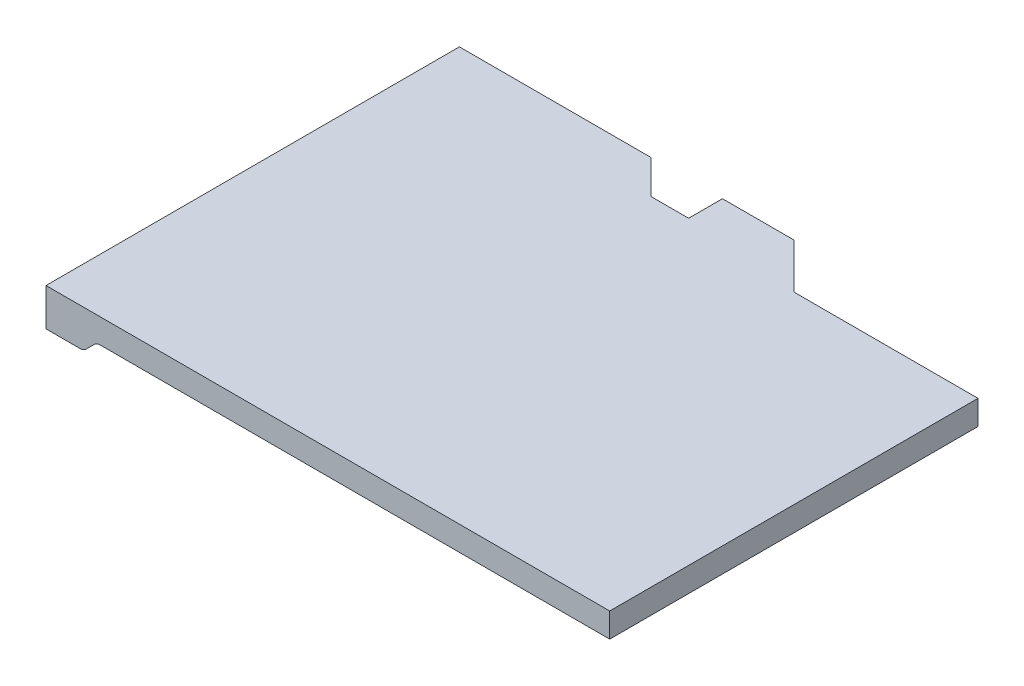
ISO-10303-21;
HEADER;
FILE_DESCRIPTION(('STEP AP214'),'2;1');
FILE_NAME('part.step','',(''),(''),'','','');
FILE_SCHEMA(('AUTOMOTIVE_DESIGN { 1 0 10303 214 1 1 1 1 }'));
ENDSEC;
DATA;
#1=APPLICATION_CONTEXT('core data for automotive mechanical design processes');
#2=APPLICATION_PROTOCOL_DEFINITION('international standard','automotive_design',2000,#1);
#3=PRODUCT_CONTEXT('',#1,'mechanical');
#4=PRODUCT('Part','Part','',(#3));
#5=PRODUCT_RELATED_PRODUCT_CATEGORY('part','',(#4));
#6=PRODUCT_DEFINITION_FORMATION('','',#4);
#7=PRODUCT_DEFINITION_CONTEXT('part definition',#1,'design');
#8=PRODUCT_DEFINITION('design','',#6,#7);
#9=PRODUCT_DEFINITION_SHAPE('','',#8);
#10=(LENGTH_UNIT() NAMED_UNIT(*) SI_UNIT(.MILLI.,.METRE.));
#11=(NAMED_UNIT(*) PLANE_ANGLE_UNIT() SI_UNIT($,.RADIAN.));
#12=(NAMED_UNIT(*) SI_UNIT($,.STERADIAN.) SOLID_ANGLE_UNIT());
#13=UNCERTAINTY_MEASURE_WITH_UNIT(LENGTH_MEASURE(1.E-05),#10,'distance_accuracy_value','');
#14=(GEOMETRIC_REPRESENTATION_CONTEXT(3) GLOBAL_UNCERTAINTY_ASSIGNED_CONTEXT((#13)) GLOBAL_UNIT_ASSIGNED_CONTEXT((#10,
#11,#12)) REPRESENTATION_CONTEXT('',''));
#15=CARTESIAN_POINT('',(0.,0.,0.));
#16=DIRECTION('',(0.,0.,1.));
#17=DIRECTION('',(1.,0.,0.));
#18=AXIS2_PLACEMENT_3D('',#15,#16,#17);
#19=CARTESIAN_POINT('',(-37.0000000000034,-9.09999999998325,12.5499999999617));
#20=DIRECTION('',(0.,0.,1.));
#21=DIRECTION('',(1.,0.,0.));
#22=AXIS2_PLACEMENT_3D('',#19,#20,#21);
#23=PLANE('',#22);
#24=DIRECTION('',(0.,-1.,0.));
#25=VECTOR('',#24,1.);
#26=CARTESIAN_POINT('',(-44.500000000006,-9.09999999998325,12.5499999999601));
#27=LINE('',#26,#25);
#28=CARTESIAN_POINT('',(-44.500000000006,-9.09999999998325,12.5499999999601));
#29=VERTEX_POINT('',#28);
#30=CARTESIAN_POINT('',(-44.500000000006,-10.0999999999833,12.5499999999601));
#31=VERTEX_POINT('',#30);
#32=EDGE_CURVE('E11',#29,#31,#27,.T.);
#33=ORIENTED_EDGE('',*,*,#32,.T.);
#34=DIRECTION('',(-1.,0.,-1.00316141586462E-12));
#35=VECTOR('',#34,1.);
#36=CARTESIAN_POINT('',(-43.6035533905924,-10.0999999999833,12.549999999961));
#37=LINE('',#36,#35);
#38=CARTESIAN_POINT('',(-43.6035533905924,-10.0999999999833,12.549999999961));
#39=VERTEX_POINT('',#38);
#40=EDGE_CURVE('E42',#39,#31,#37,.T.);
#41=ORIENTED_EDGE('',*,*,#40,.F.);
#42=CARTESIAN_POINT('',(-43.6035533905927,-9.84999999998285,12.5499999999617));
#43=DIRECTION('',(0.,0.,-1.));
#44=DIRECTION('',(1.06581410363822E-12,-1.,0.));
#45=AXIS2_PLACEMENT_3D('',#42,#43,#44);
#46=CIRCLE('',#45,0.250000000000452);
#47=CARTESIAN_POINT('',(-43.4267766952891,-10.0267766952746,12.5499999999614));
#48=VERTEX_POINT('',#47);
#49=EDGE_CURVE('E220',#48,#39,#46,.T.);
#50=ORIENTED_EDGE('',*,*,#49,.F.);
#51=DIRECTION('',(-0.707106781178456,-0.707106781194639,-6.9420765177515E-13));
#52=VECTOR('',#51,1.);
#53=CARTESIAN_POINT('',(-43.223223304717,-9.82322330469785,12.5499999999616));
#54=LINE('',#53,#52);
#55=CARTESIAN_POINT('',(-43.2232233047223,-9.8232233046926,12.5499999999617));
#56=VERTEX_POINT('',#55);
#57=EDGE_CURVE('E209',#56,#48,#54,.T.);
#58=ORIENTED_EDGE('',*,*,#57,.F.);
#59=CARTESIAN_POINT('',(-43.0464466094196,-9.9999999999834,12.5499999999617));
#60=DIRECTION('',(0.,1.06937989309214E-13,1.));
#61=DIRECTION('',(-0.707106781210313,0.707106781162782,-1.06581410363951E-13));
#62=AXIS2_PLACEMENT_3D('',#59,#60,#61);
#63=CIRCLE('',#62,0.250000000000151);
#64=CARTESIAN_POINT('',(-43.0464466094196,-9.74999999998325,12.5499999999617));
#65=VERTEX_POINT('',#64);
#66=EDGE_CURVE('E176',#65,#56,#63,.T.);
#67=ORIENTED_EDGE('',*,*,#66,.F.);
#68=DIRECTION('',(-1.,0.,-1.08527156353091E-12));
#69=VECTOR('',#68,1.);
#70=CARTESIAN_POINT('',(-29.500000000006,-9.74999999998325,12.5499999999763));
#71=LINE('',#70,#69);
#72=CARTESIAN_POINT('',(-29.500000000006,-9.74999999998325,12.5499999999763));
#73=VERTEX_POINT('',#72);
#74=EDGE_CURVE('E247',#73,#65,#71,.T.);
#75=ORIENTED_EDGE('',*,*,#74,.F.);
#76=DIRECTION('',(0.,-1.,0.));
#77=VECTOR('',#76,1.);
#78=CARTESIAN_POINT('',(-29.500000000006,-9.09999999998325,12.5499999999763));
#79=LINE('',#78,#77);
#80=CARTESIAN_POINT('',(-29.4999999999955,-9.09999999998325,12.5499999999763));
#81=VERTEX_POINT('',#80);
#82=EDGE_CURVE('E231',#81,#73,#79,.T.);
#83=ORIENTED_EDGE('',*,*,#82,.F.);
#84=DIRECTION('',(-1.,0.,-1.0800249583546E-12));
#85=VECTOR('',#84,1.);
#86=CARTESIAN_POINT('',(-29.4999999999955,-9.09999999998325,12.5499999999763));
#87=LINE('',#86,#85);
#88=EDGE_CURVE('E28',#81,#29,#87,.T.);
#89=ORIENTED_EDGE('',*,*,#88,.T.);
#90=EDGE_LOOP('',(#33,#41,#50,#58,#67,#75,#83,#89));
#91=FACE_BOUND('',#90,.T.);
#92=ADVANCED_FACE('F17',(#91),#23,.T.);
#93=CARTESIAN_POINT('',(-29.5000000000007,-9.09999999998325,7.64999999997628));
#94=DIRECTION('',(1.,0.,0.));
#95=DIRECTION('',(0.,-1.07170508295448E-12,1.));
#96=AXIS2_PLACEMENT_3D('',#93,#94,#95);
#97=PLANE('',#96);
#98=DIRECTION('',(-1.07170508295448E-12,0.,1.));
#99=VECTOR('',#98,1.);
#100=CARTESIAN_POINT('',(-29.4999999999955,-9.09999999998325,2.74999999997626));
#101=LINE('',#100,#99);
#102=CARTESIAN_POINT('',(-29.4999999999955,-9.09999999998325,2.74999999997626));
#103=VERTEX_POINT('',#102);
#104=EDGE_CURVE('E227',#103,#81,#101,.T.);
#105=ORIENTED_EDGE('',*,*,#104,.T.);
#106=ORIENTED_EDGE('',*,*,#82,.T.);
#107=DIRECTION('',(-1.07170508295448E-12,0.,1.));
#108=VECTOR('',#107,1.);
#109=CARTESIAN_POINT('',(-29.4999999999955,-9.74999999998325,2.74999999997626));
#110=LINE('',#109,#108);
#111=CARTESIAN_POINT('',(-29.4999999999955,-9.74999999998325,2.74999999997626));
#112=VERTEX_POINT('',#111);
#113=EDGE_CURVE('E160',#112,#73,#110,.T.);
#114=ORIENTED_EDGE('',*,*,#113,.F.);
#115=DIRECTION('',(0.,-1.,0.));
#116=VECTOR('',#115,1.);
#117=CARTESIAN_POINT('',(-29.4999999999955,-9.09999999998325,2.74999999997626));
#118=LINE('',#117,#116);
#119=EDGE_CURVE('E154',#103,#112,#118,.T.);
#120=ORIENTED_EDGE('',*,*,#119,.F.);
#121=EDGE_LOOP('',(#105,#106,#114,#120));
#122=FACE_BOUND('',#121,.T.);
#123=ADVANCED_FACE('F315',(#122),#97,.T.);
#124=CARTESIAN_POINT('',(-31.9499999999955,-9.09999999998325,2.74999999997362));
#125=DIRECTION('',(1.07952195935236E-12,0.,-1.));
#126=DIRECTION('',(0.,-1.,0.));
#127=AXIS2_PLACEMENT_3D('',#124,#125,#126);
#128=PLANE('',#127);
#129=DIRECTION('',(1.,0.,1.07952195935236E-12));
#130=VECTOR('',#129,1.);
#131=CARTESIAN_POINT('',(-34.3999999999955,-9.09999999998325,2.74999999997097));
#132=LINE('',#131,#130);
#133=CARTESIAN_POINT('',(-34.3999999999955,-9.09999999998325,2.74999999997097));
#134=VERTEX_POINT('',#133);
#135=EDGE_CURVE('E265',#134,#103,#132,.T.);
#136=ORIENTED_EDGE('',*,*,#135,.T.);
#137=ORIENTED_EDGE('',*,*,#119,.T.);
#138=DIRECTION('',(1.,0.,1.07952195935467E-12));
#139=VECTOR('',#138,1.);
#140=CARTESIAN_POINT('',(-34.3999999999955,-9.74999999998325,2.74999999997097));
#141=LINE('',#140,#139);
#142=CARTESIAN_POINT('',(-34.3999999999955,-9.74999999998325,2.74999999997096));
#143=VERTEX_POINT('',#142);
#144=EDGE_CURVE('E148',#143,#112,#141,.T.);
#145=ORIENTED_EDGE('',*,*,#144,.F.);
#146=DIRECTION('',(0.,-1.,0.));
#147=VECTOR('',#146,1.);
#148=CARTESIAN_POINT('',(-34.3999999999955,-9.09999999998325,2.74999999997096));
#149=LINE('',#148,#147);
#150=EDGE_CURVE('E152',#134,#143,#149,.T.);
#151=ORIENTED_EDGE('',*,*,#150,.F.);
#152=EDGE_LOOP('',(#136,#137,#145,#151));
#153=FACE_BOUND('',#152,.T.);
#154=ADVANCED_FACE('F151',(#153),#128,.T.);
#155=CARTESIAN_POINT('',(-34.9999999999948,-9.09999999998325,2.14999999997032));
#156=DIRECTION('',(0.707106781187338,0.,-0.707106781185757));
#157=DIRECTION('',(0.,-1.,0.));
#158=AXIS2_PLACEMENT_3D('',#155,#156,#157);
#159=PLANE('',#158);
#160=DIRECTION('',(0.707106781185754,0.,0.707106781187341));
#161=VECTOR('',#160,1.);
#162=CARTESIAN_POINT('',(-35.5999999999941,-9.09999999998325,1.54999999996968));
#163=LINE('',#162,#161);
#164=CARTESIAN_POINT('',(-35.5999999999941,-9.09999999998325,1.54999999996968));
#165=VERTEX_POINT('',#164);
#166=EDGE_CURVE('E168',#165,#134,#163,.T.);
#167=ORIENTED_EDGE('',*,*,#166,.T.);
#168=ORIENTED_EDGE('',*,*,#150,.T.);
#169=DIRECTION('',(0.707106781185786,0.,0.707106781187309));
#170=VECTOR('',#169,1.);
#171=CARTESIAN_POINT('',(-35.5999999999942,-9.74999999998325,1.54999999996968));
#172=LINE('',#171,#170);
#173=CARTESIAN_POINT('',(-35.5999999999941,-9.74999999998325,1.54999999996968));
#174=VERTEX_POINT('',#173);
#175=EDGE_CURVE('E165',#174,#143,#172,.T.);
#176=ORIENTED_EDGE('',*,*,#175,.F.);
#177=DIRECTION('',(0.,-1.,0.));
#178=VECTOR('',#177,1.);
#179=CARTESIAN_POINT('',(-35.5999999999941,-9.09999999998325,1.54999999996968));
#180=LINE('',#179,#178);
#181=EDGE_CURVE('E242',#165,#174,#180,.T.);
#182=ORIENTED_EDGE('',*,*,#181,.F.);
#183=EDGE_LOOP('',(#167,#168,#176,#182));
#184=FACE_BOUND('',#183,.T.);
#185=ADVANCED_FACE('F164',(#184),#159,.T.);
#186=CARTESIAN_POINT('',(-36.5499999999942,-9.09999999998325,1.54999999996866));
#187=DIRECTION('',(1.07896148156328E-12,0.,-1.));
#188=DIRECTION('',(0.,-1.,0.));
#189=AXIS2_PLACEMENT_3D('',#186,#187,#188);
#190=PLANE('',#189);
#191=DIRECTION('',(1.,0.,1.07896148156328E-12));
#192=VECTOR('',#191,1.);
#193=CARTESIAN_POINT('',(-37.4999999999942,-9.09999999998325,1.54999999996763));
#194=LINE('',#193,#192);
#195=CARTESIAN_POINT('',(-37.4999999999942,-9.09999999998325,1.54999999996763));
#196=VERTEX_POINT('',#195);
#197=EDGE_CURVE('E21',#196,#165,#194,.T.);
#198=ORIENTED_EDGE('',*,*,#197,.T.);
#199=ORIENTED_EDGE('',*,*,#181,.T.);
#200=DIRECTION('',(1.,0.,1.07896148156328E-12));
#201=VECTOR('',#200,1.);
#202=CARTESIAN_POINT('',(-37.4999999999942,-9.74999999998325,1.54999999996763));
#203=LINE('',#202,#201);
#204=CARTESIAN_POINT('',(-37.4999999999942,-9.74999999998325,1.54999999996763));
#205=VERTEX_POINT('',#204);
#206=EDGE_CURVE('E174',#205,#174,#203,.T.);
#207=ORIENTED_EDGE('',*,*,#206,.F.);
#208=DIRECTION('',(0.,-1.,0.));
#209=VECTOR('',#208,1.);
#210=CARTESIAN_POINT('',(-37.4999999999942,-9.09999999998325,1.54999999996763));
#211=LINE('',#210,#209);
#212=EDGE_CURVE('E196',#196,#205,#211,.T.);
#213=ORIENTED_EDGE('',*,*,#212,.F.);
#214=EDGE_LOOP('',(#198,#199,#207,#213));
#215=FACE_BOUND('',#214,.T.);
#216=ADVANCED_FACE('F349',(#215),#190,.T.);
#217=CARTESIAN_POINT('',(-37.4999999999947,-9.09999999998325,1.99999999996763));
#218=DIRECTION('',(-1.,0.,-9.91799235331806E-13));
#219=DIRECTION('',(-9.91799235331806E-13,0.,1.));
#220=AXIS2_PLACEMENT_3D('',#217,#218,#219);
#221=PLANE('',#220);
#222=DIRECTION('',(9.91799235331817E-13,0.,-1.));
#223=VECTOR('',#222,1.);
#224=CARTESIAN_POINT('',(-37.4999999999951,-9.09999999998325,2.44999999996762));
#225=LINE('',#224,#223);
#226=CARTESIAN_POINT('',(-37.4999999999951,-9.09999999998325,2.44999999996762));
#227=VERTEX_POINT('',#226);
#228=EDGE_CURVE('E201',#227,#196,#225,.T.);
#229=ORIENTED_EDGE('',*,*,#228,.T.);
#230=ORIENTED_EDGE('',*,*,#212,.T.);
#231=DIRECTION('',(9.91799235331817E-13,0.,-1.));
#232=VECTOR('',#231,1.);
#233=CARTESIAN_POINT('',(-37.4999999999951,-9.74999999998325,2.44999999996762));
#234=LINE('',#233,#232);
#235=CARTESIAN_POINT('',(-37.4999999999951,-9.74999999998325,2.44999999996762));
#236=VERTEX_POINT('',#235);
#237=EDGE_CURVE('E182',#236,#205,#234,.T.);
#238=ORIENTED_EDGE('',*,*,#237,.F.);
#239=DIRECTION('',(0.,-1.,0.));
#240=VECTOR('',#239,1.);
#241=CARTESIAN_POINT('',(-37.4999999999951,-9.09999999998325,2.44999999996762));
#242=LINE('',#241,#240);
#243=EDGE_CURVE('E197',#227,#236,#242,.T.);
#244=ORIENTED_EDGE('',*,*,#243,.F.);
#245=EDGE_LOOP('',(#229,#230,#238,#244));
#246=FACE_BOUND('',#245,.T.);
#247=ADVANCED_FACE('F346',(#246),#221,.T.);
#248=CARTESIAN_POINT('',(-37.9999999999951,-9.09999999998325,2.44999999996709));
#249=DIRECTION('',(1.06997743998249E-12,0.,-1.));
#250=DIRECTION('',(0.,-1.,0.));
#251=AXIS2_PLACEMENT_3D('',#248,#249,#250);
#252=PLANE('',#251);
#253=DIRECTION('',(1.,0.,1.06997743998249E-12));
#254=VECTOR('',#253,1.);
#255=CARTESIAN_POINT('',(-38.4999999999951,-9.09999999998325,2.44999999996655));
#256=LINE('',#255,#254);
#257=CARTESIAN_POINT('',(-38.4999999999951,-9.09999999998325,2.44999999996655));
#258=VERTEX_POINT('',#257);
#259=EDGE_CURVE('E192',#258,#227,#256,.T.);
#260=ORIENTED_EDGE('',*,*,#259,.T.);
#261=ORIENTED_EDGE('',*,*,#243,.T.);
#262=DIRECTION('',(1.,0.,1.06997743998249E-12));
#263=VECTOR('',#262,1.);
#264=CARTESIAN_POINT('',(-38.4999999999951,-9.74999999998325,2.44999999996655));
#265=LINE('',#264,#263);
#266=CARTESIAN_POINT('',(-38.4999999999951,-9.74999999998325,2.44999999996655));
#267=VERTEX_POINT('',#266);
#268=EDGE_CURVE('E202',#267,#236,#265,.T.);
#269=ORIENTED_EDGE('',*,*,#268,.F.);
#270=DIRECTION('',(0.,-1.,0.));
#271=VECTOR('',#270,1.);
#272=CARTESIAN_POINT('',(-38.4999999999951,-9.09999999998325,2.44999999996655));
#273=LINE('',#272,#271);
#274=EDGE_CURVE('E216',#258,#267,#273,.T.);
#275=ORIENTED_EDGE('',*,*,#274,.F.);
#276=EDGE_LOOP('',(#260,#261,#269,#275));
#277=FACE_BOUND('',#276,.T.);
#278=ADVANCED_FACE('F344',(#277),#252,.T.);
#279=CARTESIAN_POINT('',(-38.9499999999946,-9.09999999998325,1.99999999996606));
#280=DIRECTION('',(0.70710678118732,0.,-0.707106781185775));
#281=DIRECTION('',(0.,-1.,0.));
#282=AXIS2_PLACEMENT_3D('',#279,#280,#281);
#283=PLANE('',#282);
#284=DIRECTION('',(0.707106781185815,0.,0.70710678118728));
#285=VECTOR('',#284,1.);
#286=CARTESIAN_POINT('',(-39.3999999999942,-9.09999999998325,1.54999999996558));
#287=LINE('',#286,#285);
#288=CARTESIAN_POINT('',(-39.3999999999942,-9.09999999998325,1.54999999996558));
#289=VERTEX_POINT('',#288);
#290=EDGE_CURVE('E226',#289,#258,#287,.T.);
#291=ORIENTED_EDGE('',*,*,#290,.T.);
#292=ORIENTED_EDGE('',*,*,#274,.T.);
#293=DIRECTION('',(0.707106781185815,0.,0.70710678118728));
#294=VECTOR('',#293,1.);
#295=CARTESIAN_POINT('',(-39.3999999999942,-9.74999999998325,1.54999999996557));
#296=LINE('',#295,#294);
#297=CARTESIAN_POINT('',(-39.3999999999942,-9.74999999998325,1.54999999996557));
#298=VERTEX_POINT('',#297);
#299=EDGE_CURVE('E206',#298,#267,#296,.T.);
#300=ORIENTED_EDGE('',*,*,#299,.F.);
#301=DIRECTION('',(0.,-1.,0.));
#302=VECTOR('',#301,1.);
#303=CARTESIAN_POINT('',(-39.3999999999942,-9.09999999998325,1.54999999996557));
#304=LINE('',#303,#302);
#305=EDGE_CURVE('E159',#289,#298,#304,.T.);
#306=ORIENTED_EDGE('',*,*,#305,.F.);
#307=EDGE_LOOP('',(#291,#292,#300,#306));
#308=FACE_BOUND('',#307,.T.);
#309=ADVANCED_FACE('F339',(#308),#283,.T.);
#310=CARTESIAN_POINT('',(-41.95,-9.09999999998324,1.54999999996455));
#311=DIRECTION('',(0.,0.,-1.));
#312=DIRECTION('',(0.,-1.,0.));
#313=AXIS2_PLACEMENT_3D('',#310,#311,#312);
#314=PLANE('',#313);
#315=DIRECTION('',(0.,-1.,0.));
#316=VECTOR('',#315,1.);
#317=CARTESIAN_POINT('',(-44.500000000006,-9.09999999998325,1.54999999996007));
#318=LINE('',#317,#316);
#319=CARTESIAN_POINT('',(-44.500000000006,-9.09999999998325,1.54999999996007));
#320=VERTEX_POINT('',#319);
#321=CARTESIAN_POINT('',(-44.500000000006,-10.0999999999833,1.54999999996007));
#322=VERTEX_POINT('',#321);
#323=EDGE_CURVE('E256',#320,#322,#318,.T.);
#324=ORIENTED_EDGE('',*,*,#323,.F.);
#325=DIRECTION('',(1.,0.,1.08039938651018E-12));
#326=VECTOR('',#325,1.);
#327=CARTESIAN_POINT('',(-44.500000000006,-9.09999999998325,1.54999999996007));
#328=LINE('',#327,#326);
#329=EDGE_CURVE('E212',#320,#289,#328,.T.);
#330=ORIENTED_EDGE('',*,*,#329,.T.);
#331=ORIENTED_EDGE('',*,*,#305,.T.);
#332=DIRECTION('',(1.,0.,1.08047762126959E-12));
#333=VECTOR('',#332,1.);
#334=CARTESIAN_POINT('',(-43.0464466094196,-9.74999999998325,1.54999999996164));
#335=LINE('',#334,#333);
#336=CARTESIAN_POINT('',(-43.0464466094196,-9.74999999998324,1.54999999996455));
#337=VERTEX_POINT('',#336);
#338=EDGE_CURVE('E261',#337,#298,#335,.T.);
#339=ORIENTED_EDGE('',*,*,#338,.F.);
#340=CARTESIAN_POINT('',(-43.0464466094196,-9.9999999999834,1.54999999996455));
#341=DIRECTION('',(0.,0.,-1.));
#342=DIRECTION('',(0.,1.,0.));
#343=AXIS2_PLACEMENT_3D('',#340,#341,#342);
#344=CIRCLE('',#343,0.250000000000156);
#345=CARTESIAN_POINT('',(-43.2232233047223,-9.8232233046926,1.54999999996455));
#346=VERTEX_POINT('',#345);
#347=EDGE_CURVE('E185',#346,#337,#344,.T.);
#348=ORIENTED_EDGE('',*,*,#347,.F.);
#349=DIRECTION('',(0.707106781178356,0.707106781194739,4.17488768357706E-13));
#350=VECTOR('',#349,1.);
#351=CARTESIAN_POINT('',(-43.4267766952894,-10.0267766952749,1.5499999999629));
#352=LINE('',#351,#350);
#353=CARTESIAN_POINT('',(-43.4267766952894,-10.0267766952749,1.54999999996289));
#354=VERTEX_POINT('',#353);
#355=EDGE_CURVE('E207',#354,#346,#352,.T.);
#356=ORIENTED_EDGE('',*,*,#355,.F.);
#357=CARTESIAN_POINT('',(-43.6035533905927,-9.84999999998285,1.54999999996455));
#358=DIRECTION('',(0.,0.,1.));
#359=DIRECTION('',(0.707106781210169,-0.707106781162926,0.));
#360=AXIS2_PLACEMENT_3D('',#357,#358,#359);
#361=CIRCLE('',#360,0.250000000000453);
#362=CARTESIAN_POINT('',(-43.6035533905924,-10.0999999999833,1.54999999996104));
#363=VERTEX_POINT('',#362);
#364=EDGE_CURVE('E234',#363,#354,#361,.T.);
#365=ORIENTED_EDGE('',*,*,#364,.F.);
#366=DIRECTION('',(1.,0.,1.08242355242676E-12));
#367=VECTOR('',#366,1.);
#368=CARTESIAN_POINT('',(-44.500000000006,-10.0999999999833,1.54999999996007));
#369=LINE('',#368,#367);
#370=EDGE_CURVE('E270',#322,#363,#369,.T.);
#371=ORIENTED_EDGE('',*,*,#370,.F.);
#372=EDGE_LOOP('',(#324,#330,#331,#339,#348,#356,#365,#371));
#373=FACE_BOUND('',#372,.T.);
#374=ADVANCED_FACE('F330',(#373),#314,.T.);
#375=CARTESIAN_POINT('',(-29.500000000006,-9.74999999998325,7.04999999996873));
#376=DIRECTION('',(0.,-1.,0.));
#377=DIRECTION('',(-1.,0.,0.));
#378=AXIS2_PLACEMENT_3D('',#375,#376,#377);
#379=PLANE('',#378);
#380=ORIENTED_EDGE('',*,*,#144,.T.);
#381=ORIENTED_EDGE('',*,*,#113,.T.);
#382=ORIENTED_EDGE('',*,*,#74,.T.);
#383=DIRECTION('',(0.,0.,1.));
#384=VECTOR('',#383,1.);
#385=CARTESIAN_POINT('',(-43.0464466094196,-9.74999999998324,1.54999999996164));
#386=LINE('',#385,#384);
#387=EDGE_CURVE('E289',#337,#65,#386,.T.);
#388=ORIENTED_EDGE('',*,*,#387,.F.);
#389=ORIENTED_EDGE('',*,*,#338,.T.);
#390=ORIENTED_EDGE('',*,*,#299,.T.);
#391=ORIENTED_EDGE('',*,*,#268,.T.);
#392=ORIENTED_EDGE('',*,*,#237,.T.);
#393=ORIENTED_EDGE('',*,*,#206,.T.);
#394=ORIENTED_EDGE('',*,*,#175,.T.);
#395=EDGE_LOOP('',(#380,#381,#382,#388,#389,#390,#391,#392,#393,#394));
#396=FACE_BOUND('',#395,.T.);
#397=ADVANCED_FACE('F172',(#396),#379,.T.);
#398=CARTESIAN_POINT('',(-43.0464466094196,-9.99999999998356,7.04999999996156));
#399=DIRECTION('',(0.,0.,1.));
#400=DIRECTION('',(0.,1.,0.));
#401=AXIS2_PLACEMENT_3D('',#398,#399,#400);
#402=CYLINDRICAL_SURFACE('',#401,0.250000000000311);
#403=ORIENTED_EDGE('',*,*,#66,.T.);
#404=DIRECTION('',(0.,0.,1.));
#405=VECTOR('',#404,1.);
#406=CARTESIAN_POINT('',(-43.2232233047223,-9.82322330469259,1.54999999996302));
#407=LINE('',#406,#405);
#408=EDGE_CURVE('E210',#346,#56,#407,.T.);
#409=ORIENTED_EDGE('',*,*,#408,.F.);
#410=ORIENTED_EDGE('',*,*,#347,.T.);
#411=ORIENTED_EDGE('',*,*,#387,.T.);
#412=EDGE_LOOP('',(#403,#409,#410,#411));
#413=FACE_BOUND('',#412,.T.);
#414=ADVANCED_FACE('F308',(#413),#402,.F.);
#415=CARTESIAN_POINT('',(-43.1500000000179,-9.74999999998325,7.04999999996134));
#416=DIRECTION('',(0.707106781210488,-0.707106781162608,0.));
#417=DIRECTION('',(0.,0.,-1.));
#418=AXIS2_PLACEMENT_3D('',#415,#416,#417);
#419=PLANE('',#418);
#420=ORIENTED_EDGE('',*,*,#57,.T.);
#421=DIRECTION('',(0.,0.,1.));
#422=VECTOR('',#421,1.);
#423=CARTESIAN_POINT('',(-43.4267766952898,-10.0267766952739,1.54999999996289));
#424=LINE('',#423,#422);
#425=EDGE_CURVE('E190',#354,#48,#424,.T.);
#426=ORIENTED_EDGE('',*,*,#425,.F.);
#427=ORIENTED_EDGE('',*,*,#355,.T.);
#428=ORIENTED_EDGE('',*,*,#408,.T.);
#429=EDGE_LOOP('',(#420,#426,#427,#428));
#430=FACE_BOUND('',#429,.T.);
#431=ADVANCED_FACE('F335',(#430),#419,.T.);
#432=CARTESIAN_POINT('',(-43.6035533905926,-9.84999999998303,7.04999999996119));
#433=DIRECTION('',(0.,0.,-1.));
#434=DIRECTION('',(0.707106781210453,-0.707106781162642,0.));
#435=AXIS2_PLACEMENT_3D('',#432,#433,#434);
#436=CYLINDRICAL_SURFACE('',#435,0.25000000000029);
#437=ORIENTED_EDGE('',*,*,#49,.T.);
#438=DIRECTION('',(0.,0.,1.));
#439=VECTOR('',#438,1.);
#440=CARTESIAN_POINT('',(-43.6035533905924,-10.0999999999833,1.54999999996104));
#441=LINE('',#440,#439);
#442=EDGE_CURVE('E255',#363,#39,#441,.T.);
#443=ORIENTED_EDGE('',*,*,#442,.F.);
#444=ORIENTED_EDGE('',*,*,#364,.T.);
#445=ORIENTED_EDGE('',*,*,#425,.T.);
#446=EDGE_LOOP('',(#437,#443,#444,#445));
#447=FACE_BOUND('',#446,.T.);
#448=ADVANCED_FACE('F333',(#447),#436,.T.);
#449=CARTESIAN_POINT('',(-44.500000000006,-10.0999999999833,7.04999999996064));
#450=DIRECTION('',(0.,-1.,0.));
#451=DIRECTION('',(0.,0.,-1.));
#452=AXIS2_PLACEMENT_3D('',#449,#450,#451);
#453=PLANE('',#452);
#454=ORIENTED_EDGE('',*,*,#40,.T.);
#455=DIRECTION('',(0.,0.,-1.));
#456=VECTOR('',#455,1.);
#457=CARTESIAN_POINT('',(-44.500000000006,-10.0999999999833,12.5499999999601));
#458=LINE('',#457,#456);
#459=EDGE_CURVE('E191',#31,#322,#458,.T.);
#460=ORIENTED_EDGE('',*,*,#459,.T.);
#461=ORIENTED_EDGE('',*,*,#370,.T.);
#462=ORIENTED_EDGE('',*,*,#442,.T.);
#463=EDGE_LOOP('',(#454,#460,#461,#462));
#464=FACE_BOUND('',#463,.T.);
#465=ADVANCED_FACE('F325',(#464),#453,.T.);
#466=CARTESIAN_POINT('',(-44.500000000006,-9.09999999998325,7.04999999996009));
#467=DIRECTION('',(-1.,0.,0.));
#468=DIRECTION('',(0.,0.,1.));
#469=AXIS2_PLACEMENT_3D('',#466,#467,#468);
#470=PLANE('',#469);
#471=ORIENTED_EDGE('',*,*,#459,.F.);
#472=ORIENTED_EDGE('',*,*,#32,.F.);
#473=DIRECTION('',(0.,0.,-1.));
#474=VECTOR('',#473,1.);
#475=CARTESIAN_POINT('',(-44.500000000006,-9.09999999998325,12.5499999999601));
#476=LINE('',#475,#474);
#477=EDGE_CURVE('E251',#29,#320,#476,.T.);
#478=ORIENTED_EDGE('',*,*,#477,.T.);
#479=ORIENTED_EDGE('',*,*,#323,.T.);
#480=EDGE_LOOP('',(#471,#472,#478,#479));
#481=FACE_BOUND('',#480,.T.);
#482=ADVANCED_FACE('F323',(#481),#470,.T.);
#483=CARTESIAN_POINT('',(-37.0000000000007,-9.09999999998325,12.5499999999763));
#484=DIRECTION('',(0.,1.,0.));
#485=DIRECTION('',(1.,0.,0.));
#486=AXIS2_PLACEMENT_3D('',#483,#484,#485);
#487=PLANE('',#486);
#488=ORIENTED_EDGE('',*,*,#135,.F.);
#489=ORIENTED_EDGE('',*,*,#166,.F.);
#490=ORIENTED_EDGE('',*,*,#197,.F.);
#491=ORIENTED_EDGE('',*,*,#228,.F.);
#492=ORIENTED_EDGE('',*,*,#259,.F.);
#493=ORIENTED_EDGE('',*,*,#290,.F.);
#494=ORIENTED_EDGE('',*,*,#329,.F.);
#495=ORIENTED_EDGE('',*,*,#477,.F.);
#496=ORIENTED_EDGE('',*,*,#88,.F.);
#497=ORIENTED_EDGE('',*,*,#104,.F.);
#498=EDGE_LOOP('',(#488,#489,#490,#491,#492,#493,#494,#495,#496,#497));
#499=FACE_BOUND('',#498,.T.);
#500=ADVANCED_FACE('F19',(#499),#487,.T.);
#501=CLOSED_SHELL('',(#92,#123,#154,#185,#216,#247,#278,#309,#374,#397,#414,#431,#448,#465,#482,#500));
#502=MANIFOLD_SOLID_BREP('B1',#501);
#503=ADVANCED_BREP_SHAPE_REPRESENTATION('',(#18,#502),#14);
#504=SHAPE_DEFINITION_REPRESENTATION(#9,#503);
ENDSEC;
END-ISO-10303-21;
